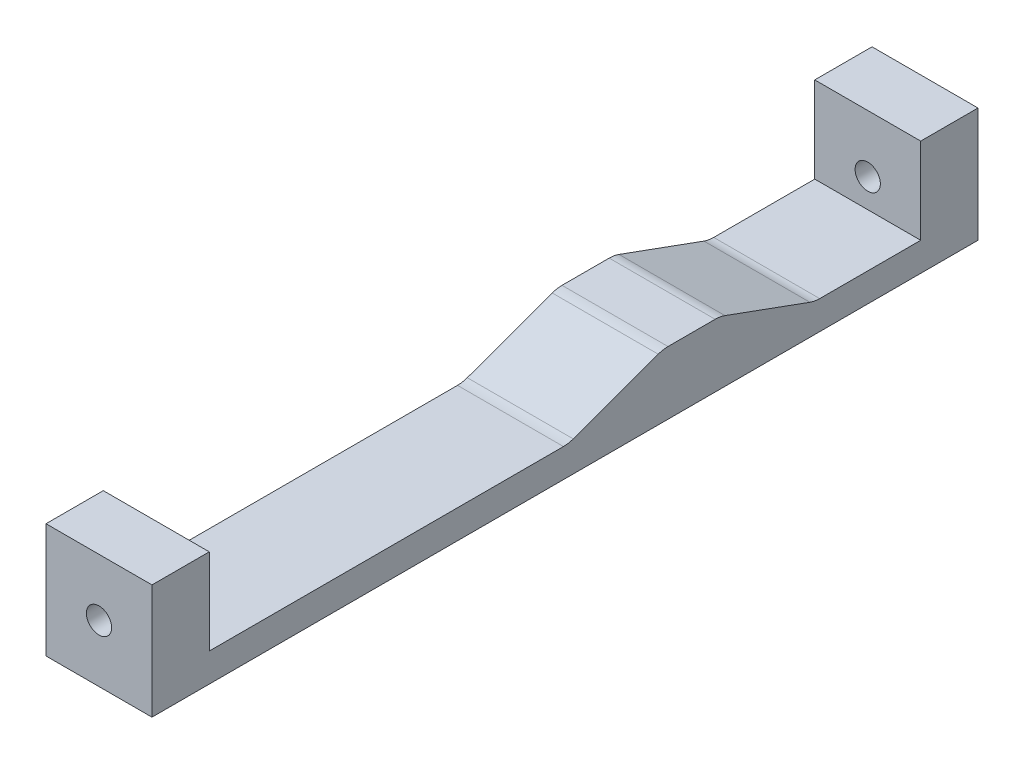
ISO-10303-21;
HEADER;
FILE_DESCRIPTION(('STEP AP214'),'2;1');
FILE_NAME('part.step','',(''),(''),'','','');
FILE_SCHEMA(('AUTOMOTIVE_DESIGN { 1 0 10303 214 1 1 1 1 }'));
ENDSEC;
DATA;
#1=APPLICATION_CONTEXT('core data for automotive mechanical design processes');
#2=APPLICATION_PROTOCOL_DEFINITION('international standard','automotive_design',2000,#1);
#3=PRODUCT_CONTEXT('',#1,'mechanical');
#4=PRODUCT('Part','Part','',(#3));
#5=PRODUCT_RELATED_PRODUCT_CATEGORY('part','',(#4));
#6=PRODUCT_DEFINITION_FORMATION('','',#4);
#7=PRODUCT_DEFINITION_CONTEXT('part definition',#1,'design');
#8=PRODUCT_DEFINITION('design','',#6,#7);
#9=PRODUCT_DEFINITION_SHAPE('','',#8);
#10=(LENGTH_UNIT() NAMED_UNIT(*) SI_UNIT(.MILLI.,.METRE.));
#11=(NAMED_UNIT(*) PLANE_ANGLE_UNIT() SI_UNIT($,.RADIAN.));
#12=(NAMED_UNIT(*) SI_UNIT($,.STERADIAN.) SOLID_ANGLE_UNIT());
#13=UNCERTAINTY_MEASURE_WITH_UNIT(LENGTH_MEASURE(1.E-05),#10,'distance_accuracy_value','');
#14=(GEOMETRIC_REPRESENTATION_CONTEXT(3) GLOBAL_UNCERTAINTY_ASSIGNED_CONTEXT((#13)) GLOBAL_UNIT_ASSIGNED_CONTEXT((#10,
#11,#12)) REPRESENTATION_CONTEXT('',''));
#15=CARTESIAN_POINT('',(0.,0.,0.));
#16=DIRECTION('',(0.,0.,1.));
#17=DIRECTION('',(1.,0.,0.));
#18=AXIS2_PLACEMENT_3D('',#15,#16,#17);
#19=CARTESIAN_POINT('',(0.,3.175,0.));
#20=DIRECTION('',(0.,-1.,0.));
#21=DIRECTION('',(0.,0.,-1.));
#22=AXIS2_PLACEMENT_3D('',#19,#20,#21);
#23=PLANE('',#22);
#24=DIRECTION('',(0.,0.,1.));
#25=VECTOR('',#24,1.);
#26=CARTESIAN_POINT('',(-5.87375,3.175,45.7835));
#27=LINE('',#26,#25);
#28=CARTESIAN_POINT('',(-5.87375,3.175,-39.4335));
#29=VERTEX_POINT('',#28);
#30=CARTESIAN_POINT('',(-5.87375,3.175,-28.2362271318717));
#31=VERTEX_POINT('',#30);
#32=EDGE_CURVE('E177',#29,#31,#27,.T.);
#33=ORIENTED_EDGE('',*,*,#32,.T.);
#34=DIRECTION('',(-1.,0.,0.));
#35=VECTOR('',#34,1.);
#36=CARTESIAN_POINT('',(0.,3.175,-28.2362271318717));
#37=LINE('',#36,#35);
#38=CARTESIAN_POINT('',(5.87375,3.175,-28.2362271318717));
#39=VERTEX_POINT('',#38);
#40=EDGE_CURVE('E263',#31,#39,#37,.F.);
#41=ORIENTED_EDGE('',*,*,#40,.T.);
#42=DIRECTION('',(0.,0.,-1.));
#43=VECTOR('',#42,1.);
#44=CARTESIAN_POINT('',(5.87375,3.175,45.7835));
#45=LINE('',#44,#43);
#46=CARTESIAN_POINT('',(5.87375,3.175,-39.4335));
#47=VERTEX_POINT('',#46);
#48=EDGE_CURVE('E213',#39,#47,#45,.T.);
#49=ORIENTED_EDGE('',*,*,#48,.T.);
#50=DIRECTION('',(1.,0.,0.));
#51=VECTOR('',#50,1.);
#52=CARTESIAN_POINT('',(-5.87375,3.175,-39.4335));
#53=LINE('',#52,#51);
#54=EDGE_CURVE('E171',#29,#47,#53,.T.);
#55=ORIENTED_EDGE('',*,*,#54,.F.);
#56=EDGE_LOOP('',(#33,#41,#49,#55));
#57=FACE_BOUND('',#56,.T.);
#58=ADVANCED_FACE('F37',(#57),#23,.F.);
#59=CARTESIAN_POINT('',(5.87375,3.175,45.7835));
#60=DIRECTION('',(-1.,0.,0.));
#61=DIRECTION('',(0.,0.,1.));
#62=AXIS2_PLACEMENT_3D('',#59,#60,#61);
#63=PLANE('',#62);
#64=DIRECTION('',(0.,0.,1.));
#65=VECTOR('',#64,1.);
#66=CARTESIAN_POINT('',(5.87375,6.985,-17.2085));
#67=LINE('',#66,#65);
#68=CARTESIAN_POINT('',(5.87375,6.985,-16.6486618362506));
#69=VERTEX_POINT('',#68);
#70=CARTESIAN_POINT('',(5.87375,6.985,-11.4183381637494));
#71=VERTEX_POINT('',#70);
#72=EDGE_CURVE('E279',#69,#71,#67,.T.);
#73=ORIENTED_EDGE('',*,*,#72,.T.);
#74=CARTESIAN_POINT('',(5.87375,3.81,-11.4183381637494));
#75=DIRECTION('',(-1.,0.,0.));
#76=DIRECTION('',(0.,0.,1.));
#77=AXIS2_PLACEMENT_3D('',#74,#75,#76);
#78=CIRCLE('',#77,3.175);
#79=CARTESIAN_POINT('',(5.87375,6.79352407099527,-10.3324242086904));
#80=VERTEX_POINT('',#79);
#81=EDGE_CURVE('E257',#71,#80,#78,.F.);
#82=ORIENTED_EDGE('',*,*,#81,.T.);
#83=DIRECTION('',(0.,-0.342020143325663,0.939692620785911));
#84=VECTOR('',#83,1.);
#85=CARTESIAN_POINT('',(5.87375,3.175,-0.390611031877673));
#86=LINE('',#85,#84);
#87=CARTESIAN_POINT('',(5.87375,3.36647592900473,-0.916686823187285));
#88=VERTEX_POINT('',#87);
#89=EDGE_CURVE('E283',#80,#88,#86,.T.);
#90=ORIENTED_EDGE('',*,*,#89,.T.);
#91=CARTESIAN_POINT('',(5.87375,6.35,0.169227131871694));
#92=DIRECTION('',(-1.,0.,0.));
#93=DIRECTION('',(0.,0.,1.));
#94=AXIS2_PLACEMENT_3D('',#91,#92,#93);
#95=CIRCLE('',#94,3.175);
#96=CARTESIAN_POINT('',(5.87375,3.175,0.169227131871695));
#97=VERTEX_POINT('',#96);
#98=EDGE_CURVE('E267',#88,#97,#95,.T.);
#99=ORIENTED_EDGE('',*,*,#98,.T.);
#100=CARTESIAN_POINT('',(5.87375,3.175,39.4335));
#101=VERTEX_POINT('',#100);
#102=EDGE_CURVE('E209',#101,#97,#45,.T.);
#103=ORIENTED_EDGE('',*,*,#102,.F.);
#104=DIRECTION('',(0.,1.,0.));
#105=VECTOR('',#104,1.);
#106=CARTESIAN_POINT('',(5.87375,3.175,39.4335));
#107=LINE('',#106,#105);
#108=CARTESIAN_POINT('',(5.87375,12.7,39.4335));
#109=VERTEX_POINT('',#108);
#110=EDGE_CURVE('E194',#101,#109,#107,.T.);
#111=ORIENTED_EDGE('',*,*,#110,.T.);
#112=DIRECTION('',(0.,0.,1.));
#113=VECTOR('',#112,1.);
#114=CARTESIAN_POINT('',(5.87375,12.7,39.4335));
#115=LINE('',#114,#113);
#116=CARTESIAN_POINT('',(5.87375,12.7,45.7835));
#117=VERTEX_POINT('',#116);
#118=EDGE_CURVE('E200',#109,#117,#115,.T.);
#119=ORIENTED_EDGE('',*,*,#118,.T.);
#120=DIRECTION('',(0.,-1.,0.));
#121=VECTOR('',#120,1.);
#122=CARTESIAN_POINT('',(5.87375,3.175,45.7835));
#123=LINE('',#122,#121);
#124=CARTESIAN_POINT('',(5.87375,0.,45.7835));
#125=VERTEX_POINT('',#124);
#126=EDGE_CURVE('E215',#117,#125,#123,.T.);
#127=ORIENTED_EDGE('',*,*,#126,.T.);
#128=DIRECTION('',(0.,0.,-1.));
#129=VECTOR('',#128,1.);
#130=CARTESIAN_POINT('',(5.87375,0.,45.7835));
#131=LINE('',#130,#129);
#132=CARTESIAN_POINT('',(5.87375,0.,-45.7835));
#133=VERTEX_POINT('',#132);
#134=EDGE_CURVE('E206',#125,#133,#131,.T.);
#135=ORIENTED_EDGE('',*,*,#134,.T.);
#136=DIRECTION('',(0.,-1.,0.));
#137=VECTOR('',#136,1.);
#138=CARTESIAN_POINT('',(5.87375,3.175,-45.7835));
#139=LINE('',#138,#137);
#140=CARTESIAN_POINT('',(5.87375,12.7,-45.7835));
#141=VERTEX_POINT('',#140);
#142=EDGE_CURVE('E231',#141,#133,#139,.T.);
#143=ORIENTED_EDGE('',*,*,#142,.F.);
#144=DIRECTION('',(0.,0.,-1.));
#145=VECTOR('',#144,1.);
#146=CARTESIAN_POINT('',(5.87375,12.7,-39.4335));
#147=LINE('',#146,#145);
#148=CARTESIAN_POINT('',(5.87375,12.7,-39.4335));
#149=VERTEX_POINT('',#148);
#150=EDGE_CURVE('E170',#149,#141,#147,.T.);
#151=ORIENTED_EDGE('',*,*,#150,.F.);
#152=DIRECTION('',(0.,1.,0.));
#153=VECTOR('',#152,1.);
#154=CARTESIAN_POINT('',(5.87375,3.175,-39.4335));
#155=LINE('',#154,#153);
#156=EDGE_CURVE('E157',#47,#149,#155,.T.);
#157=ORIENTED_EDGE('',*,*,#156,.F.);
#158=ORIENTED_EDGE('',*,*,#48,.F.);
#159=CARTESIAN_POINT('',(5.87375,6.35,-28.2362271318717));
#160=DIRECTION('',(-1.,0.,0.));
#161=DIRECTION('',(0.,0.,1.));
#162=AXIS2_PLACEMENT_3D('',#159,#160,#161);
#163=CIRCLE('',#162,3.175);
#164=CARTESIAN_POINT('',(5.87375,3.36647592900473,-27.1503131768127));
#165=VERTEX_POINT('',#164);
#166=EDGE_CURVE('E11',#39,#165,#163,.T.);
#167=ORIENTED_EDGE('',*,*,#166,.T.);
#168=DIRECTION('',(0.,0.342020143325663,0.93969262078591));
#169=VECTOR('',#168,1.);
#170=CARTESIAN_POINT('',(5.87375,6.985,-17.2085));
#171=LINE('',#170,#169);
#172=CARTESIAN_POINT('',(5.87375,6.79352407099527,-17.7345757913096));
#173=VERTEX_POINT('',#172);
#174=EDGE_CURVE('E276',#165,#173,#171,.T.);
#175=ORIENTED_EDGE('',*,*,#174,.T.);
#176=CARTESIAN_POINT('',(5.87375,3.81,-16.6486618362506));
#177=DIRECTION('',(-1.,0.,0.));
#178=DIRECTION('',(0.,0.,1.));
#179=AXIS2_PLACEMENT_3D('',#176,#177,#178);
#180=CIRCLE('',#179,3.175);
#181=EDGE_CURVE('E255',#173,#69,#180,.F.);
#182=ORIENTED_EDGE('',*,*,#181,.T.);
#183=EDGE_LOOP('',(#73,#82,#90,#99,#103,#111,#119,#127,#135,#143,#151,#157,#158,#167,#175,#182));
#184=FACE_BOUND('',#183,.T.);
#185=ADVANCED_FACE('F313',(#184),#63,.F.);
#186=CARTESIAN_POINT('',(-5.87375,3.175,-45.7835));
#187=DIRECTION('',(0.,0.,1.));
#188=DIRECTION('',(1.,0.,0.));
#189=AXIS2_PLACEMENT_3D('',#186,#187,#188);
#190=PLANE('',#189);
#191=CARTESIAN_POINT('',(0.,6.35,-45.7835));
#192=DIRECTION('',(0.,0.,1.));
#193=DIRECTION('',(1.,0.,0.));
#194=AXIS2_PLACEMENT_3D('',#191,#192,#193);
#195=CIRCLE('',#194,1.399999994);
#196=CARTESIAN_POINT('',(1.399999994,6.35,-45.7835));
#197=VERTEX_POINT('',#196);
#198=EDGE_CURVE('E238',#197,#197,#195,.T.);
#199=ORIENTED_EDGE('',*,*,#198,.T.);
#200=EDGE_LOOP('',(#199));
#201=FACE_BOUND('',#200,.T.);
#202=DIRECTION('',(-1.,0.,0.));
#203=VECTOR('',#202,1.);
#204=CARTESIAN_POINT('',(-5.87375,0.,-45.7835));
#205=LINE('',#204,#203);
#206=CARTESIAN_POINT('',(-5.87375,0.,-45.7835));
#207=VERTEX_POINT('',#206);
#208=EDGE_CURVE('E218',#133,#207,#205,.T.);
#209=ORIENTED_EDGE('',*,*,#208,.T.);
#210=DIRECTION('',(0.,-1.,0.));
#211=VECTOR('',#210,1.);
#212=CARTESIAN_POINT('',(-5.87375,3.175,-45.7835));
#213=LINE('',#212,#211);
#214=CARTESIAN_POINT('',(-5.87375,12.7,-45.7835));
#215=VERTEX_POINT('',#214);
#216=EDGE_CURVE('E229',#215,#207,#213,.T.);
#217=ORIENTED_EDGE('',*,*,#216,.F.);
#218=DIRECTION('',(-1.,0.,0.));
#219=VECTOR('',#218,1.);
#220=CARTESIAN_POINT('',(-5.87375,12.7,-45.7835));
#221=LINE('',#220,#219);
#222=EDGE_CURVE('E167',#141,#215,#221,.T.);
#223=ORIENTED_EDGE('',*,*,#222,.F.);
#224=ORIENTED_EDGE('',*,*,#142,.T.);
#225=EDGE_LOOP('',(#209,#217,#223,#224));
#226=FACE_BOUND('',#225,.T.);
#227=ADVANCED_FACE('F296',(#201,#226),#190,.F.);
#228=CARTESIAN_POINT('',(-5.87375,3.175,45.7835));
#229=DIRECTION('',(1.,0.,0.));
#230=DIRECTION('',(0.,0.,-1.));
#231=AXIS2_PLACEMENT_3D('',#228,#229,#230);
#232=PLANE('',#231);
#233=DIRECTION('',(0.,0.342020143325663,-0.939692620785911));
#234=VECTOR('',#233,1.);
#235=CARTESIAN_POINT('',(-5.87375,3.175,-0.390611031877673));
#236=LINE('',#235,#234);
#237=CARTESIAN_POINT('',(-5.87375,3.36647592900473,-0.916686823187285));
#238=VERTEX_POINT('',#237);
#239=CARTESIAN_POINT('',(-5.87375,6.79352407099527,-10.3324242086904));
#240=VERTEX_POINT('',#239);
#241=EDGE_CURVE('E288',#238,#240,#236,.T.);
#242=ORIENTED_EDGE('',*,*,#241,.T.);
#243=CARTESIAN_POINT('',(-5.87375,3.81,-11.4183381637494));
#244=DIRECTION('',(1.,0.,0.));
#245=DIRECTION('',(0.,0.,-1.));
#246=AXIS2_PLACEMENT_3D('',#243,#244,#245);
#247=CIRCLE('',#246,3.175);
#248=CARTESIAN_POINT('',(-5.87375,6.985,-11.4183381637494));
#249=VERTEX_POINT('',#248);
#250=EDGE_CURVE('E248',#240,#249,#247,.F.);
#251=ORIENTED_EDGE('',*,*,#250,.T.);
#252=DIRECTION('',(0.,0.,-1.));
#253=VECTOR('',#252,1.);
#254=CARTESIAN_POINT('',(-5.87375,6.985,-17.2085));
#255=LINE('',#254,#253);
#256=CARTESIAN_POINT('',(-5.87375,6.985,-16.6486618362506));
#257=VERTEX_POINT('',#256);
#258=EDGE_CURVE('E290',#249,#257,#255,.T.);
#259=ORIENTED_EDGE('',*,*,#258,.T.);
#260=CARTESIAN_POINT('',(-5.87375,3.81,-16.6486618362506));
#261=DIRECTION('',(1.,0.,0.));
#262=DIRECTION('',(0.,0.,-1.));
#263=AXIS2_PLACEMENT_3D('',#260,#261,#262);
#264=CIRCLE('',#263,3.175);
#265=CARTESIAN_POINT('',(-5.87375,6.79352407099527,-17.7345757913096));
#266=VERTEX_POINT('',#265);
#267=EDGE_CURVE('E246',#257,#266,#264,.F.);
#268=ORIENTED_EDGE('',*,*,#267,.T.);
#269=DIRECTION('',(0.,-0.342020143325663,-0.93969262078591));
#270=VECTOR('',#269,1.);
#271=CARTESIAN_POINT('',(-5.87375,6.985,-17.2085));
#272=LINE('',#271,#270);
#273=CARTESIAN_POINT('',(-5.87375,3.36647592900473,-27.1503131768127));
#274=VERTEX_POINT('',#273);
#275=EDGE_CURVE('E269',#266,#274,#272,.T.);
#276=ORIENTED_EDGE('',*,*,#275,.T.);
#277=CARTESIAN_POINT('',(-5.87375,6.35,-28.2362271318717));
#278=DIRECTION('',(1.,0.,0.));
#279=DIRECTION('',(0.,0.,-1.));
#280=AXIS2_PLACEMENT_3D('',#277,#278,#279);
#281=CIRCLE('',#280,3.175);
#282=EDGE_CURVE('E45',#274,#31,#281,.T.);
#283=ORIENTED_EDGE('',*,*,#282,.T.);
#284=ORIENTED_EDGE('',*,*,#32,.F.);
#285=DIRECTION('',(0.,-1.,0.));
#286=VECTOR('',#285,1.);
#287=CARTESIAN_POINT('',(-5.87375,3.175,-39.4335));
#288=LINE('',#287,#286);
#289=CARTESIAN_POINT('',(-5.87375,12.7,-39.4335));
#290=VERTEX_POINT('',#289);
#291=EDGE_CURVE('E155',#290,#29,#288,.T.);
#292=ORIENTED_EDGE('',*,*,#291,.F.);
#293=DIRECTION('',(0.,0.,-1.));
#294=VECTOR('',#293,1.);
#295=CARTESIAN_POINT('',(-5.87375,12.7,-39.4335));
#296=LINE('',#295,#294);
#297=EDGE_CURVE('E164',#290,#215,#296,.T.);
#298=ORIENTED_EDGE('',*,*,#297,.T.);
#299=ORIENTED_EDGE('',*,*,#216,.T.);
#300=DIRECTION('',(0.,0.,1.));
#301=VECTOR('',#300,1.);
#302=CARTESIAN_POINT('',(-5.87375,0.,45.7835));
#303=LINE('',#302,#301);
#304=CARTESIAN_POINT('',(-5.87375,0.,45.7835));
#305=VERTEX_POINT('',#304);
#306=EDGE_CURVE('E220',#207,#305,#303,.T.);
#307=ORIENTED_EDGE('',*,*,#306,.T.);
#308=DIRECTION('',(0.,-1.,0.));
#309=VECTOR('',#308,1.);
#310=CARTESIAN_POINT('',(-5.87375,3.175,45.7835));
#311=LINE('',#310,#309);
#312=CARTESIAN_POINT('',(-5.87375,12.7,45.7835));
#313=VERTEX_POINT('',#312);
#314=EDGE_CURVE('E226',#313,#305,#311,.T.);
#315=ORIENTED_EDGE('',*,*,#314,.F.);
#316=DIRECTION('',(0.,0.,1.));
#317=VECTOR('',#316,1.);
#318=CARTESIAN_POINT('',(-5.87375,12.7,39.4335));
#319=LINE('',#318,#317);
#320=CARTESIAN_POINT('',(-5.87375,12.7,39.4335));
#321=VERTEX_POINT('',#320);
#322=EDGE_CURVE('E203',#321,#313,#319,.T.);
#323=ORIENTED_EDGE('',*,*,#322,.F.);
#324=DIRECTION('',(0.,-1.,0.));
#325=VECTOR('',#324,1.);
#326=CARTESIAN_POINT('',(-5.87375,3.175,39.4335));
#327=LINE('',#326,#325);
#328=CARTESIAN_POINT('',(-5.87375,3.175,39.4335));
#329=VERTEX_POINT('',#328);
#330=EDGE_CURVE('E188',#321,#329,#327,.T.);
#331=ORIENTED_EDGE('',*,*,#330,.T.);
#332=CARTESIAN_POINT('',(-5.87375,3.175,0.169227131871695));
#333=VERTEX_POINT('',#332);
#334=EDGE_CURVE('E212',#333,#329,#27,.T.);
#335=ORIENTED_EDGE('',*,*,#334,.F.);
#336=CARTESIAN_POINT('',(-5.87375,6.35,0.169227131871694));
#337=DIRECTION('',(1.,0.,0.));
#338=DIRECTION('',(0.,0.,-1.));
#339=AXIS2_PLACEMENT_3D('',#336,#337,#338);
#340=CIRCLE('',#339,3.175);
#341=EDGE_CURVE('E265',#333,#238,#340,.T.);
#342=ORIENTED_EDGE('',*,*,#341,.T.);
#343=EDGE_LOOP('',(#242,#251,#259,#268,#276,#283,#284,#292,#298,#299,#307,#315,#323,#331,#335,#342));
#344=FACE_BOUND('',#343,.T.);
#345=ADVANCED_FACE('F175',(#344),#232,.F.);
#346=CARTESIAN_POINT('',(-5.87375,3.175,45.7835));
#347=DIRECTION('',(0.,0.,-1.));
#348=DIRECTION('',(-1.,0.,0.));
#349=AXIS2_PLACEMENT_3D('',#346,#347,#348);
#350=PLANE('',#349);
#351=CARTESIAN_POINT('',(0.,6.35,45.7835));
#352=DIRECTION('',(0.,0.,1.));
#353=DIRECTION('',(1.,0.,0.));
#354=AXIS2_PLACEMENT_3D('',#351,#352,#353);
#355=CIRCLE('',#354,1.399999994);
#356=CARTESIAN_POINT('',(1.399999994,6.35,45.7835));
#357=VERTEX_POINT('',#356);
#358=EDGE_CURVE('E278',#357,#357,#355,.T.);
#359=ORIENTED_EDGE('',*,*,#358,.F.);
#360=EDGE_LOOP('',(#359));
#361=FACE_BOUND('',#360,.T.);
#362=DIRECTION('',(1.,0.,0.));
#363=VECTOR('',#362,1.);
#364=CARTESIAN_POINT('',(-5.87375,0.,45.7835));
#365=LINE('',#364,#363);
#366=EDGE_CURVE('E222',#305,#125,#365,.T.);
#367=ORIENTED_EDGE('',*,*,#366,.T.);
#368=ORIENTED_EDGE('',*,*,#126,.F.);
#369=DIRECTION('',(-1.,0.,0.));
#370=VECTOR('',#369,1.);
#371=CARTESIAN_POINT('',(-5.87375,12.7,45.7835));
#372=LINE('',#371,#370);
#373=EDGE_CURVE('E186',#117,#313,#372,.T.);
#374=ORIENTED_EDGE('',*,*,#373,.T.);
#375=ORIENTED_EDGE('',*,*,#314,.T.);
#376=EDGE_LOOP('',(#367,#368,#374,#375));
#377=FACE_BOUND('',#376,.T.);
#378=ADVANCED_FACE('F326',(#361,#377),#350,.F.);
#379=ORIENTED_EDGE('',*,*,#102,.T.);
#380=DIRECTION('',(-1.,0.,0.));
#381=VECTOR('',#380,1.);
#382=CARTESIAN_POINT('',(0.,3.175,0.169227131871694));
#383=LINE('',#382,#381);
#384=EDGE_CURVE('E234',#97,#333,#383,.T.);
#385=ORIENTED_EDGE('',*,*,#384,.T.);
#386=ORIENTED_EDGE('',*,*,#334,.T.);
#387=DIRECTION('',(1.,0.,0.));
#388=VECTOR('',#387,1.);
#389=CARTESIAN_POINT('',(-5.87375,3.175,39.4335));
#390=LINE('',#389,#388);
#391=EDGE_CURVE('E191',#329,#101,#390,.T.);
#392=ORIENTED_EDGE('',*,*,#391,.T.);
#393=EDGE_LOOP('',(#379,#385,#386,#392));
#394=FACE_BOUND('',#393,.T.);
#395=ADVANCED_FACE('F315',(#394),#23,.F.);
#396=CARTESIAN_POINT('',(0.,0.,0.));
#397=DIRECTION('',(0.,-1.,0.));
#398=DIRECTION('',(0.,0.,-1.));
#399=AXIS2_PLACEMENT_3D('',#396,#397,#398);
#400=PLANE('',#399);
#401=ORIENTED_EDGE('',*,*,#134,.F.);
#402=ORIENTED_EDGE('',*,*,#366,.F.);
#403=ORIENTED_EDGE('',*,*,#306,.F.);
#404=ORIENTED_EDGE('',*,*,#208,.F.);
#405=EDGE_LOOP('',(#401,#402,#403,#404));
#406=FACE_BOUND('',#405,.T.);
#407=ADVANCED_FACE('F325',(#406),#400,.T.);
#408=CARTESIAN_POINT('',(-5.87375,12.7,39.4335));
#409=DIRECTION('',(0.,1.,0.));
#410=DIRECTION('',(0.,0.,1.));
#411=AXIS2_PLACEMENT_3D('',#408,#409,#410);
#412=PLANE('',#411);
#413=ORIENTED_EDGE('',*,*,#373,.F.);
#414=ORIENTED_EDGE('',*,*,#118,.F.);
#415=DIRECTION('',(-1.,0.,0.));
#416=VECTOR('',#415,1.);
#417=CARTESIAN_POINT('',(-5.87375,12.7,39.4335));
#418=LINE('',#417,#416);
#419=EDGE_CURVE('E197',#109,#321,#418,.T.);
#420=ORIENTED_EDGE('',*,*,#419,.T.);
#421=ORIENTED_EDGE('',*,*,#322,.T.);
#422=EDGE_LOOP('',(#413,#414,#420,#421));
#423=FACE_BOUND('',#422,.T.);
#424=ADVANCED_FACE('F333',(#423),#412,.T.);
#425=CARTESIAN_POINT('',(0.,0.,39.4335));
#426=DIRECTION('',(0.,0.,-1.));
#427=DIRECTION('',(-1.,0.,0.));
#428=AXIS2_PLACEMENT_3D('',#425,#426,#427);
#429=PLANE('',#428);
#430=CARTESIAN_POINT('',(0.,6.35,39.4335));
#431=DIRECTION('',(0.,0.,-1.));
#432=DIRECTION('',(-1.,0.,0.));
#433=AXIS2_PLACEMENT_3D('',#430,#431,#432);
#434=CIRCLE('',#433,1.399999994);
#435=CARTESIAN_POINT('',(-1.399999994,6.35,39.4335));
#436=VERTEX_POINT('',#435);
#437=EDGE_CURVE('E179',#436,#436,#434,.T.);
#438=ORIENTED_EDGE('',*,*,#437,.F.);
#439=EDGE_LOOP('',(#438));
#440=FACE_BOUND('',#439,.T.);
#441=ORIENTED_EDGE('',*,*,#330,.F.);
#442=ORIENTED_EDGE('',*,*,#419,.F.);
#443=ORIENTED_EDGE('',*,*,#110,.F.);
#444=ORIENTED_EDGE('',*,*,#391,.F.);
#445=EDGE_LOOP('',(#441,#442,#443,#444));
#446=FACE_BOUND('',#445,.T.);
#447=ADVANCED_FACE('F463',(#440,#446),#429,.T.);
#448=CARTESIAN_POINT('',(-5.87375,12.7,-39.4335));
#449=DIRECTION('',(0.,-1.,0.));
#450=DIRECTION('',(0.,0.,-1.));
#451=AXIS2_PLACEMENT_3D('',#448,#449,#450);
#452=PLANE('',#451);
#453=ORIENTED_EDGE('',*,*,#222,.T.);
#454=ORIENTED_EDGE('',*,*,#297,.F.);
#455=DIRECTION('',(-1.,0.,0.));
#456=VECTOR('',#455,1.);
#457=CARTESIAN_POINT('',(-5.87375,12.7,-39.4335));
#458=LINE('',#457,#456);
#459=EDGE_CURVE('E150',#149,#290,#458,.T.);
#460=ORIENTED_EDGE('',*,*,#459,.F.);
#461=ORIENTED_EDGE('',*,*,#150,.T.);
#462=EDGE_LOOP('',(#453,#454,#460,#461));
#463=FACE_BOUND('',#462,.T.);
#464=ADVANCED_FACE('F165',(#463),#452,.F.);
#465=CARTESIAN_POINT('',(0.,0.,-39.4335));
#466=DIRECTION('',(0.,0.,1.));
#467=DIRECTION('',(-1.,0.,0.));
#468=AXIS2_PLACEMENT_3D('',#465,#466,#467);
#469=PLANE('',#468);
#470=CARTESIAN_POINT('',(0.,6.35,-39.4335));
#471=DIRECTION('',(0.,0.,1.));
#472=DIRECTION('',(1.,0.,0.));
#473=AXIS2_PLACEMENT_3D('',#470,#471,#472);
#474=CIRCLE('',#473,1.399999994);
#475=CARTESIAN_POINT('',(1.399999994,6.35,-39.4335));
#476=VERTEX_POINT('',#475);
#477=EDGE_CURVE('E235',#476,#476,#474,.T.);
#478=ORIENTED_EDGE('',*,*,#477,.F.);
#479=EDGE_LOOP('',(#478));
#480=FACE_BOUND('',#479,.T.);
#481=ORIENTED_EDGE('',*,*,#291,.T.);
#482=ORIENTED_EDGE('',*,*,#54,.T.);
#483=ORIENTED_EDGE('',*,*,#156,.T.);
#484=ORIENTED_EDGE('',*,*,#459,.T.);
#485=EDGE_LOOP('',(#481,#482,#483,#484));
#486=FACE_BOUND('',#485,.T.);
#487=ADVANCED_FACE('F152',(#480,#486),#469,.T.);
#488=CARTESIAN_POINT('',(0.,6.35,-45.7835));
#489=DIRECTION('',(0.,0.,1.));
#490=DIRECTION('',(1.,0.,0.));
#491=AXIS2_PLACEMENT_3D('',#488,#489,#490);
#492=CYLINDRICAL_SURFACE('',#491,1.399999994);
#493=ORIENTED_EDGE('',*,*,#477,.T.);
#494=EDGE_LOOP('',(#493));
#495=FACE_BOUND('',#494,.T.);
#496=ORIENTED_EDGE('',*,*,#198,.F.);
#497=EDGE_LOOP('',(#496));
#498=FACE_BOUND('',#497,.T.);
#499=ADVANCED_FACE('F299',(#495,#498),#492,.F.);
#500=ORIENTED_EDGE('',*,*,#437,.T.);
#501=EDGE_LOOP('',(#500));
#502=FACE_BOUND('',#501,.T.);
#503=ORIENTED_EDGE('',*,*,#358,.T.);
#504=EDGE_LOOP('',(#503));
#505=FACE_BOUND('',#504,.T.);
#506=ADVANCED_FACE('F301',(#502,#505),#492,.F.);
#507=CARTESIAN_POINT('',(33.4242450515604,6.985,-17.2085));
#508=DIRECTION('',(0.,0.93969262078591,-0.342020143325663));
#509=DIRECTION('',(0.,0.342020143325663,0.93969262078591));
#510=AXIS2_PLACEMENT_3D('',#507,#508,#509);
#511=PLANE('',#510);
#512=ORIENTED_EDGE('',*,*,#174,.F.);
#513=DIRECTION('',(-1.,0.,0.));
#514=VECTOR('',#513,1.);
#515=CARTESIAN_POINT('',(33.4242450515604,3.36647592900473,-27.1503131768127));
#516=LINE('',#515,#514);
#517=EDGE_CURVE('E260',#165,#274,#516,.T.);
#518=ORIENTED_EDGE('',*,*,#517,.T.);
#519=ORIENTED_EDGE('',*,*,#275,.F.);
#520=DIRECTION('',(-1.,0.,0.));
#521=VECTOR('',#520,1.);
#522=CARTESIAN_POINT('',(33.4242450515604,6.79352407099527,-17.7345757913096));
#523=LINE('',#522,#521);
#524=EDGE_CURVE('E52',#266,#173,#523,.F.);
#525=ORIENTED_EDGE('',*,*,#524,.T.);
#526=EDGE_LOOP('',(#512,#518,#519,#525));
#527=FACE_BOUND('',#526,.T.);
#528=ADVANCED_FACE('F275',(#527),#511,.T.);
#529=CARTESIAN_POINT('',(33.4242450515604,6.985,-17.2085));
#530=DIRECTION('',(0.,1.,0.));
#531=DIRECTION('',(0.,0.,1.));
#532=AXIS2_PLACEMENT_3D('',#529,#530,#531);
#533=PLANE('',#532);
#534=ORIENTED_EDGE('',*,*,#258,.F.);
#535=DIRECTION('',(-1.,0.,0.));
#536=VECTOR('',#535,1.);
#537=CARTESIAN_POINT('',(33.4242450515604,6.985,-11.4183381637494));
#538=LINE('',#537,#536);
#539=EDGE_CURVE('E253',#249,#71,#538,.F.);
#540=ORIENTED_EDGE('',*,*,#539,.T.);
#541=ORIENTED_EDGE('',*,*,#72,.F.);
#542=DIRECTION('',(-1.,0.,0.));
#543=VECTOR('',#542,1.);
#544=CARTESIAN_POINT('',(33.4242450515604,6.985,-16.6486618362506));
#545=LINE('',#544,#543);
#546=EDGE_CURVE('E250',#69,#257,#545,.T.);
#547=ORIENTED_EDGE('',*,*,#546,.T.);
#548=EDGE_LOOP('',(#534,#540,#541,#547));
#549=FACE_BOUND('',#548,.T.);
#550=ADVANCED_FACE('F358',(#549),#533,.T.);
#551=CARTESIAN_POINT('',(33.4242450515604,3.175,-0.390611031877673));
#552=DIRECTION('',(0.,0.939692620785911,0.342020143325663));
#553=DIRECTION('',(0.,-0.342020143325663,0.939692620785911));
#554=AXIS2_PLACEMENT_3D('',#551,#552,#553);
#555=PLANE('',#554);
#556=ORIENTED_EDGE('',*,*,#241,.F.);
#557=DIRECTION('',(-1.,0.,0.));
#558=VECTOR('',#557,1.);
#559=CARTESIAN_POINT('',(33.4242450515604,3.36647592900473,-0.916686823187285));
#560=LINE('',#559,#558);
#561=EDGE_CURVE('E244',#238,#88,#560,.F.);
#562=ORIENTED_EDGE('',*,*,#561,.T.);
#563=ORIENTED_EDGE('',*,*,#89,.F.);
#564=DIRECTION('',(-1.,0.,0.));
#565=VECTOR('',#564,1.);
#566=CARTESIAN_POINT('',(33.4242450515604,6.79352407099527,-10.3324242086904));
#567=LINE('',#566,#565);
#568=EDGE_CURVE('E241',#80,#240,#567,.T.);
#569=ORIENTED_EDGE('',*,*,#568,.T.);
#570=EDGE_LOOP('',(#556,#562,#563,#569));
#571=FACE_BOUND('',#570,.T.);
#572=ADVANCED_FACE('F348',(#571),#555,.T.);
#573=CARTESIAN_POINT('',(0.,6.35,0.169227131871694));
#574=DIRECTION('',(-1.,0.,0.));
#575=DIRECTION('',(0.,0.,1.));
#576=AXIS2_PLACEMENT_3D('',#573,#574,#575);
#577=CYLINDRICAL_SURFACE('',#576,3.175);
#578=ORIENTED_EDGE('',*,*,#98,.F.);
#579=ORIENTED_EDGE('',*,*,#561,.F.);
#580=ORIENTED_EDGE('',*,*,#341,.F.);
#581=ORIENTED_EDGE('',*,*,#384,.F.);
#582=EDGE_LOOP('',(#578,#579,#580,#581));
#583=FACE_BOUND('',#582,.T.);
#584=ADVANCED_FACE('F344',(#583),#577,.F.);
#585=CARTESIAN_POINT('',(33.4242450515604,3.81,-11.4183381637494));
#586=DIRECTION('',(-1.,0.,0.));
#587=DIRECTION('',(0.,0.,1.));
#588=AXIS2_PLACEMENT_3D('',#585,#586,#587);
#589=CYLINDRICAL_SURFACE('',#588,3.175);
#590=ORIENTED_EDGE('',*,*,#81,.F.);
#591=ORIENTED_EDGE('',*,*,#539,.F.);
#592=ORIENTED_EDGE('',*,*,#250,.F.);
#593=ORIENTED_EDGE('',*,*,#568,.F.);
#594=EDGE_LOOP('',(#590,#591,#592,#593));
#595=FACE_BOUND('',#594,.T.);
#596=ADVANCED_FACE('F354',(#595),#589,.T.);
#597=CARTESIAN_POINT('',(33.4242450515604,6.35,-28.2362271318717));
#598=DIRECTION('',(-1.,0.,0.));
#599=DIRECTION('',(0.,0.,1.));
#600=AXIS2_PLACEMENT_3D('',#597,#598,#599);
#601=CYLINDRICAL_SURFACE('',#600,3.175);
#602=ORIENTED_EDGE('',*,*,#166,.F.);
#603=ORIENTED_EDGE('',*,*,#40,.F.);
#604=ORIENTED_EDGE('',*,*,#282,.F.);
#605=ORIENTED_EDGE('',*,*,#517,.F.);
#606=EDGE_LOOP('',(#602,#603,#604,#605));
#607=FACE_BOUND('',#606,.T.);
#608=ADVANCED_FACE('F274',(#607),#601,.F.);
#609=CARTESIAN_POINT('',(33.4242450515604,3.81,-16.6486618362506));
#610=DIRECTION('',(-1.,0.,0.));
#611=DIRECTION('',(0.,0.,1.));
#612=AXIS2_PLACEMENT_3D('',#609,#610,#611);
#613=CYLINDRICAL_SURFACE('',#612,3.175);
#614=ORIENTED_EDGE('',*,*,#181,.F.);
#615=ORIENTED_EDGE('',*,*,#524,.F.);
#616=ORIENTED_EDGE('',*,*,#267,.F.);
#617=ORIENTED_EDGE('',*,*,#546,.F.);
#618=EDGE_LOOP('',(#614,#615,#616,#617));
#619=FACE_BOUND('',#618,.T.);
#620=ADVANCED_FACE('F39',(#619),#613,.T.);
#621=CLOSED_SHELL('',(#58,#185,#227,#345,#378,#395,#407,#424,#447,#464,#487,#499,#506,#528,#550,
#572,#584,#596,#608,#620));
#622=MANIFOLD_SOLID_BREP('B2',#621);
#623=ADVANCED_BREP_SHAPE_REPRESENTATION('',(#18,#622),#14);
#624=SHAPE_DEFINITION_REPRESENTATION(#9,#623);
ENDSEC;
END-ISO-10303-21;
